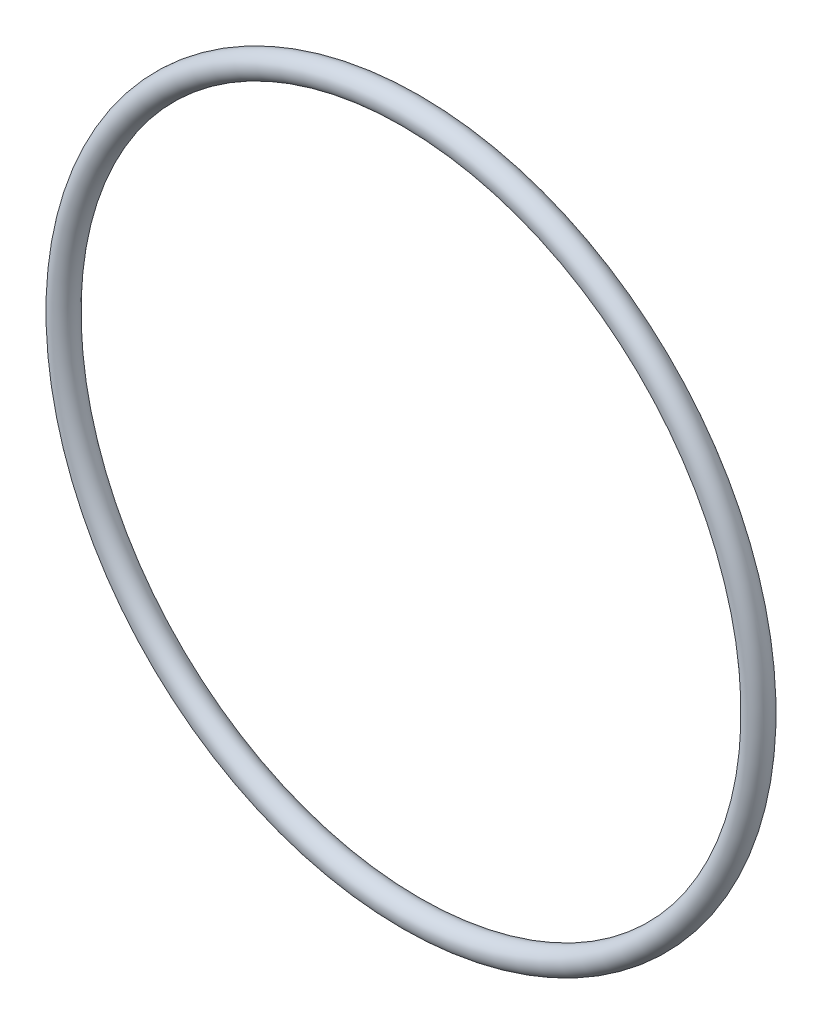
ISO-10303-21;
HEADER;
FILE_DESCRIPTION(('STEP AP214'),'2;1');
FILE_NAME('part.step','',(''),(''),'','','');
FILE_SCHEMA(('AUTOMOTIVE_DESIGN { 1 0 10303 214 1 1 1 1 }'));
ENDSEC;
DATA;
#1=APPLICATION_CONTEXT('core data for automotive mechanical design processes');
#2=APPLICATION_PROTOCOL_DEFINITION('international standard','automotive_design',2000,#1);
#3=PRODUCT_CONTEXT('',#1,'mechanical');
#4=PRODUCT('Part','Part','',(#3));
#5=PRODUCT_RELATED_PRODUCT_CATEGORY('part','',(#4));
#6=PRODUCT_DEFINITION_FORMATION('','',#4);
#7=PRODUCT_DEFINITION_CONTEXT('part definition',#1,'design');
#8=PRODUCT_DEFINITION('design','',#6,#7);
#9=PRODUCT_DEFINITION_SHAPE('','',#8);
#10=(LENGTH_UNIT() NAMED_UNIT(*) SI_UNIT(.MILLI.,.METRE.));
#11=(NAMED_UNIT(*) PLANE_ANGLE_UNIT() SI_UNIT($,.RADIAN.));
#12=(NAMED_UNIT(*) SI_UNIT($,.STERADIAN.) SOLID_ANGLE_UNIT());
#13=UNCERTAINTY_MEASURE_WITH_UNIT(LENGTH_MEASURE(1.E-05),#10,'distance_accuracy_value','');
#14=(GEOMETRIC_REPRESENTATION_CONTEXT(3) GLOBAL_UNCERTAINTY_ASSIGNED_CONTEXT((#13)) GLOBAL_UNIT_ASSIGNED_CONTEXT((#10,
#11,#12)) REPRESENTATION_CONTEXT('',''));
#15=CARTESIAN_POINT('',(0.,0.,0.));
#16=DIRECTION('',(0.,0.,1.));
#17=DIRECTION('',(1.,0.,0.));
#18=AXIS2_PLACEMENT_3D('',#15,#16,#17);
#19=CARTESIAN_POINT('',(0.,0.,0.8));
#20=DIRECTION('',(0.,0.,-1.));
#21=DIRECTION('',(0.,1.,0.));
#22=AXIS2_PLACEMENT_3D('',#19,#20,#21);
#23=TOROIDAL_SURFACE('',#22,1.4,0.0499999999999999);
#24=CARTESIAN_POINT('',(0.,1.45,0.8));
#25=VERTEX_POINT('',#24);
#26=VERTEX_LOOP('',#25);
#27=FACE_BOUND('',#26,.T.);
#28=ADVANCED_FACE('F13',(#27),#23,.T.);
#29=CLOSED_SHELL('',(#28));
#30=MANIFOLD_SOLID_BREP('B1',#29);
#31=ADVANCED_BREP_SHAPE_REPRESENTATION('',(#18,#30),#14);
#32=SHAPE_DEFINITION_REPRESENTATION(#9,#31);
ENDSEC;
END-ISO-10303-21;
